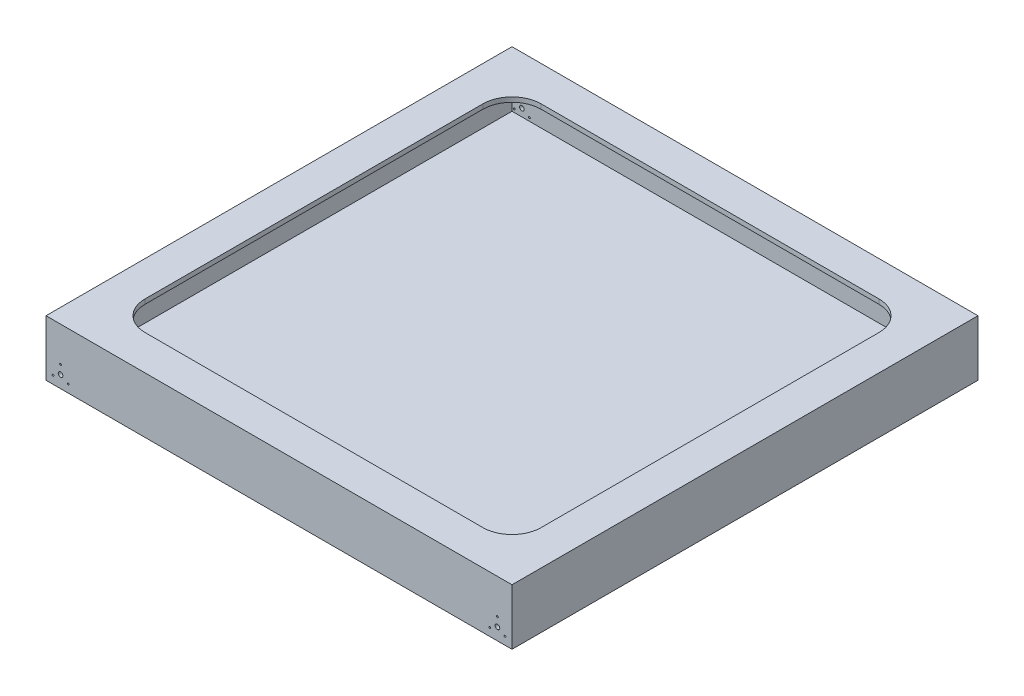
ISO-10303-21;
HEADER;
FILE_DESCRIPTION(('STEP AP214'),'2;1');
FILE_NAME('part.step','',(''),(''),'','','');
FILE_SCHEMA(('AUTOMOTIVE_DESIGN { 1 0 10303 214 1 1 1 1 }'));
ENDSEC;
DATA;
#1=APPLICATION_CONTEXT('core data for automotive mechanical design processes');
#2=APPLICATION_PROTOCOL_DEFINITION('international standard','automotive_design',2000,#1);
#3=PRODUCT_CONTEXT('',#1,'mechanical');
#4=PRODUCT('Part','Part','',(#3));
#5=PRODUCT_RELATED_PRODUCT_CATEGORY('part','',(#4));
#6=PRODUCT_DEFINITION_FORMATION('','',#4);
#7=PRODUCT_DEFINITION_CONTEXT('part definition',#1,'design');
#8=PRODUCT_DEFINITION('design','',#6,#7);
#9=PRODUCT_DEFINITION_SHAPE('','',#8);
#10=(LENGTH_UNIT() NAMED_UNIT(*) SI_UNIT(.MILLI.,.METRE.));
#11=(NAMED_UNIT(*) PLANE_ANGLE_UNIT() SI_UNIT($,.RADIAN.));
#12=(NAMED_UNIT(*) SI_UNIT($,.STERADIAN.) SOLID_ANGLE_UNIT());
#13=UNCERTAINTY_MEASURE_WITH_UNIT(LENGTH_MEASURE(1.E-05),#10,'distance_accuracy_value','');
#14=(GEOMETRIC_REPRESENTATION_CONTEXT(3) GLOBAL_UNCERTAINTY_ASSIGNED_CONTEXT((#13)) GLOBAL_UNIT_ASSIGNED_CONTEXT((#10,
#11,#12)) REPRESENTATION_CONTEXT('',''));
#15=CARTESIAN_POINT('',(0.,0.,0.));
#16=DIRECTION('',(0.,0.,1.));
#17=DIRECTION('',(1.,0.,0.));
#18=AXIS2_PLACEMENT_3D('',#15,#16,#17);
#19=CARTESIAN_POINT('',(-400.,8.,400.));
#20=DIRECTION('',(1.,0.,0.));
#21=DIRECTION('',(0.,0.,-1.));
#22=AXIS2_PLACEMENT_3D('',#19,#20,#21);
#23=PLANE('',#22);
#24=DIRECTION('',(0.,0.,1.));
#25=VECTOR('',#24,1.);
#26=CARTESIAN_POINT('',(-400.,0.,400.));
#27=LINE('',#26,#25);
#28=CARTESIAN_POINT('',(-400.,0.,-400.));
#29=VERTEX_POINT('',#28);
#30=CARTESIAN_POINT('',(-400.,0.,400.));
#31=VERTEX_POINT('',#30);
#32=EDGE_CURVE('E260',#29,#31,#27,.T.);
#33=ORIENTED_EDGE('',*,*,#32,.T.);
#34=DIRECTION('',(0.,-1.,0.));
#35=VECTOR('',#34,1.);
#36=CARTESIAN_POINT('',(-400.,8.,400.));
#37=LINE('',#36,#35);
#38=CARTESIAN_POINT('',(-400.,96.,400.));
#39=VERTEX_POINT('',#38);
#40=EDGE_CURVE('E11',#39,#31,#37,.T.);
#41=ORIENTED_EDGE('',*,*,#40,.F.);
#42=DIRECTION('',(0.,0.,1.));
#43=VECTOR('',#42,1.);
#44=CARTESIAN_POINT('',(-400.,96.,400.));
#45=LINE('',#44,#43);
#46=CARTESIAN_POINT('',(-400.,96.,-400.));
#47=VERTEX_POINT('',#46);
#48=EDGE_CURVE('E165',#47,#39,#45,.T.);
#49=ORIENTED_EDGE('',*,*,#48,.F.);
#50=DIRECTION('',(0.,-1.,0.));
#51=VECTOR('',#50,1.);
#52=CARTESIAN_POINT('',(-400.,8.,-400.));
#53=LINE('',#52,#51);
#54=EDGE_CURVE('E269',#47,#29,#53,.T.);
#55=ORIENTED_EDGE('',*,*,#54,.T.);
#56=EDGE_LOOP('',(#33,#41,#49,#55));
#57=FACE_BOUND('',#56,.T.);
#58=ADVANCED_FACE('F34',(#57),#23,.F.);
#59=CARTESIAN_POINT('',(400.,8.,400.));
#60=DIRECTION('',(0.,0.,-1.));
#61=DIRECTION('',(-1.,0.,0.));
#62=AXIS2_PLACEMENT_3D('',#59,#60,#61);
#63=PLANE('',#62);
#64=CARTESIAN_POINT('',(-387.990381056767,13.5000000000001,400.));
#65=DIRECTION('',(0.,0.,1.));
#66=DIRECTION('',(1.,0.,0.));
#67=AXIS2_PLACEMENT_3D('',#64,#65,#66);
#68=CIRCLE('',#67,1.49999999999997);
#69=CARTESIAN_POINT('',(-386.490381056767,13.5000000000001,400.));
#70=VERTEX_POINT('',#69);
#71=EDGE_CURVE('E330',#70,#70,#68,.T.);
#72=ORIENTED_EDGE('',*,*,#71,.F.);
#73=EDGE_LOOP('',(#72));
#74=FACE_BOUND('',#73,.T.);
#75=CARTESIAN_POINT('',(-362.009618943233,13.4999999999999,400.));
#76=DIRECTION('',(0.,0.,1.));
#77=DIRECTION('',(1.,0.,0.));
#78=AXIS2_PLACEMENT_3D('',#75,#76,#77);
#79=CIRCLE('',#78,1.50000000000009);
#80=CARTESIAN_POINT('',(-360.509618943233,13.4999999999999,400.));
#81=VERTEX_POINT('',#80);
#82=EDGE_CURVE('E336',#81,#81,#79,.T.);
#83=ORIENTED_EDGE('',*,*,#82,.F.);
#84=EDGE_LOOP('',(#83));
#85=FACE_BOUND('',#84,.T.);
#86=CARTESIAN_POINT('',(362.009618943234,13.4999999999999,400.));
#87=DIRECTION('',(0.,0.,1.));
#88=DIRECTION('',(-1.,0.,0.));
#89=AXIS2_PLACEMENT_3D('',#86,#87,#88);
#90=CIRCLE('',#89,1.49999999999997);
#91=CARTESIAN_POINT('',(360.509618943234,13.4999999999999,400.));
#92=VERTEX_POINT('',#91);
#93=EDGE_CURVE('E342',#92,#92,#90,.T.);
#94=ORIENTED_EDGE('',*,*,#93,.F.);
#95=EDGE_LOOP('',(#94));
#96=FACE_BOUND('',#95,.T.);
#97=CARTESIAN_POINT('',(387.990381056767,13.5000000000001,400.));
#98=DIRECTION('',(0.,0.,1.));
#99=DIRECTION('',(-1.,0.,0.));
#100=AXIS2_PLACEMENT_3D('',#97,#98,#99);
#101=CIRCLE('',#100,1.49999999999997);
#102=CARTESIAN_POINT('',(386.490381056767,13.5000000000001,400.));
#103=VERTEX_POINT('',#102);
#104=EDGE_CURVE('E348',#103,#103,#101,.T.);
#105=ORIENTED_EDGE('',*,*,#104,.F.);
#106=EDGE_LOOP('',(#105));
#107=FACE_BOUND('',#106,.T.);
#108=CARTESIAN_POINT('',(375.,36.,400.));
#109=DIRECTION('',(0.,0.,1.));
#110=DIRECTION('',(-1.,0.,0.));
#111=AXIS2_PLACEMENT_3D('',#108,#109,#110);
#112=CIRCLE('',#111,1.49999999999985);
#113=CARTESIAN_POINT('',(373.5,36.,400.));
#114=VERTEX_POINT('',#113);
#115=EDGE_CURVE('E313',#114,#114,#112,.T.);
#116=ORIENTED_EDGE('',*,*,#115,.F.);
#117=EDGE_LOOP('',(#116));
#118=FACE_BOUND('',#117,.T.);
#119=CARTESIAN_POINT('',(-375.,36.,400.));
#120=DIRECTION('',(0.,0.,1.));
#121=DIRECTION('',(1.,0.,0.));
#122=AXIS2_PLACEMENT_3D('',#119,#120,#121);
#123=CIRCLE('',#122,1.49999999999997);
#124=CARTESIAN_POINT('',(-373.5,36.,400.));
#125=VERTEX_POINT('',#124);
#126=EDGE_CURVE('E363',#125,#125,#123,.T.);
#127=ORIENTED_EDGE('',*,*,#126,.F.);
#128=EDGE_LOOP('',(#127));
#129=FACE_BOUND('',#128,.T.);
#130=CARTESIAN_POINT('',(375.,21.,400.));
#131=DIRECTION('',(0.,0.,1.));
#132=DIRECTION('',(-1.,0.,0.));
#133=AXIS2_PLACEMENT_3D('',#130,#131,#132);
#134=CIRCLE('',#133,3.99999999999999);
#135=CARTESIAN_POINT('',(371.,21.,400.));
#136=VERTEX_POINT('',#135);
#137=EDGE_CURVE('E370',#136,#136,#134,.T.);
#138=ORIENTED_EDGE('',*,*,#137,.F.);
#139=EDGE_LOOP('',(#138));
#140=FACE_BOUND('',#139,.T.);
#141=CARTESIAN_POINT('',(-375.,21.,400.));
#142=DIRECTION('',(0.,0.,1.));
#143=DIRECTION('',(1.,0.,0.));
#144=AXIS2_PLACEMENT_3D('',#141,#142,#143);
#145=CIRCLE('',#144,3.99999999999999);
#146=CARTESIAN_POINT('',(-371.,21.,400.));
#147=VERTEX_POINT('',#146);
#148=EDGE_CURVE('E377',#147,#147,#145,.T.);
#149=ORIENTED_EDGE('',*,*,#148,.F.);
#150=EDGE_LOOP('',(#149));
#151=FACE_BOUND('',#150,.T.);
#152=DIRECTION('',(1.,0.,0.));
#153=VECTOR('',#152,1.);
#154=CARTESIAN_POINT('',(400.,0.,400.));
#155=LINE('',#154,#153);
#156=CARTESIAN_POINT('',(400.,0.,400.));
#157=VERTEX_POINT('',#156);
#158=EDGE_CURVE('E263',#31,#157,#155,.T.);
#159=ORIENTED_EDGE('',*,*,#158,.T.);
#160=DIRECTION('',(0.,-1.,0.));
#161=VECTOR('',#160,1.);
#162=CARTESIAN_POINT('',(400.,8.,400.));
#163=LINE('',#162,#161);
#164=CARTESIAN_POINT('',(400.,96.,400.));
#165=VERTEX_POINT('',#164);
#166=EDGE_CURVE('E42',#165,#157,#163,.T.);
#167=ORIENTED_EDGE('',*,*,#166,.F.);
#168=DIRECTION('',(1.,0.,0.));
#169=VECTOR('',#168,1.);
#170=CARTESIAN_POINT('',(400.,96.,400.));
#171=LINE('',#170,#169);
#172=EDGE_CURVE('E222',#39,#165,#171,.T.);
#173=ORIENTED_EDGE('',*,*,#172,.F.);
#174=ORIENTED_EDGE('',*,*,#40,.T.);
#175=EDGE_LOOP('',(#159,#167,#173,#174));
#176=FACE_BOUND('',#175,.T.);
#177=ADVANCED_FACE('F444',(#74,#85,#96,#107,#118,#129,#140,#151,#176),#63,.F.);
#178=CARTESIAN_POINT('',(400.,8.,400.));
#179=DIRECTION('',(-1.,0.,0.));
#180=DIRECTION('',(0.,0.,1.));
#181=AXIS2_PLACEMENT_3D('',#178,#179,#180);
#182=PLANE('',#181);
#183=DIRECTION('',(0.,0.,-1.));
#184=VECTOR('',#183,1.);
#185=CARTESIAN_POINT('',(400.,0.,400.));
#186=LINE('',#185,#184);
#187=CARTESIAN_POINT('',(400.,0.,-400.));
#188=VERTEX_POINT('',#187);
#189=EDGE_CURVE('E265',#157,#188,#186,.T.);
#190=ORIENTED_EDGE('',*,*,#189,.T.);
#191=DIRECTION('',(0.,-1.,0.));
#192=VECTOR('',#191,1.);
#193=CARTESIAN_POINT('',(400.,8.,-400.));
#194=LINE('',#193,#192);
#195=CARTESIAN_POINT('',(400.,96.,-400.));
#196=VERTEX_POINT('',#195);
#197=EDGE_CURVE('E272',#196,#188,#194,.T.);
#198=ORIENTED_EDGE('',*,*,#197,.F.);
#199=DIRECTION('',(0.,0.,-1.));
#200=VECTOR('',#199,1.);
#201=CARTESIAN_POINT('',(400.,96.,400.));
#202=LINE('',#201,#200);
#203=EDGE_CURVE('E225',#165,#196,#202,.T.);
#204=ORIENTED_EDGE('',*,*,#203,.F.);
#205=ORIENTED_EDGE('',*,*,#166,.T.);
#206=EDGE_LOOP('',(#190,#198,#204,#205));
#207=FACE_BOUND('',#206,.T.);
#208=ADVANCED_FACE('F449',(#207),#182,.F.);
#209=CARTESIAN_POINT('',(400.,8.,-400.));
#210=DIRECTION('',(0.,0.,1.));
#211=DIRECTION('',(1.,0.,0.));
#212=AXIS2_PLACEMENT_3D('',#209,#210,#211);
#213=PLANE('',#212);
#214=CARTESIAN_POINT('',(-387.990381056767,13.5000000000001,-400.));
#215=DIRECTION('',(0.,0.,1.));
#216=DIRECTION('',(1.,0.,0.));
#217=AXIS2_PLACEMENT_3D('',#214,#215,#216);
#218=CIRCLE('',#217,1.49999999999997);
#219=CARTESIAN_POINT('',(-386.490381056767,13.5000000000001,-400.));
#220=VERTEX_POINT('',#219);
#221=EDGE_CURVE('E295',#220,#220,#218,.T.);
#222=ORIENTED_EDGE('',*,*,#221,.T.);
#223=EDGE_LOOP('',(#222));
#224=FACE_BOUND('',#223,.T.);
#225=CARTESIAN_POINT('',(-362.009618943233,13.4999999999999,-400.));
#226=DIRECTION('',(0.,0.,1.));
#227=DIRECTION('',(1.,0.,0.));
#228=AXIS2_PLACEMENT_3D('',#225,#226,#227);
#229=CIRCLE('',#228,1.50000000000009);
#230=CARTESIAN_POINT('',(-360.509618943233,13.4999999999999,-400.));
#231=VERTEX_POINT('',#230);
#232=EDGE_CURVE('E333',#231,#231,#229,.T.);
#233=ORIENTED_EDGE('',*,*,#232,.T.);
#234=EDGE_LOOP('',(#233));
#235=FACE_BOUND('',#234,.T.);
#236=CARTESIAN_POINT('',(362.009618943234,13.4999999999999,-400.));
#237=DIRECTION('',(0.,0.,1.));
#238=DIRECTION('',(-1.,0.,0.));
#239=AXIS2_PLACEMENT_3D('',#236,#237,#238);
#240=CIRCLE('',#239,1.49999999999997);
#241=CARTESIAN_POINT('',(360.509618943234,13.4999999999999,-400.));
#242=VERTEX_POINT('',#241);
#243=EDGE_CURVE('E339',#242,#242,#240,.T.);
#244=ORIENTED_EDGE('',*,*,#243,.T.);
#245=EDGE_LOOP('',(#244));
#246=FACE_BOUND('',#245,.T.);
#247=CARTESIAN_POINT('',(387.990381056767,13.5000000000001,-400.));
#248=DIRECTION('',(0.,0.,1.));
#249=DIRECTION('',(-1.,0.,0.));
#250=AXIS2_PLACEMENT_3D('',#247,#248,#249);
#251=CIRCLE('',#250,1.49999999999997);
#252=CARTESIAN_POINT('',(386.490381056767,13.5000000000001,-400.));
#253=VERTEX_POINT('',#252);
#254=EDGE_CURVE('E345',#253,#253,#251,.T.);
#255=ORIENTED_EDGE('',*,*,#254,.T.);
#256=EDGE_LOOP('',(#255));
#257=FACE_BOUND('',#256,.T.);
#258=CARTESIAN_POINT('',(375.,36.,-400.));
#259=DIRECTION('',(0.,0.,1.));
#260=DIRECTION('',(-1.,0.,0.));
#261=AXIS2_PLACEMENT_3D('',#258,#259,#260);
#262=CIRCLE('',#261,1.49999999999985);
#263=CARTESIAN_POINT('',(373.5,36.,-400.));
#264=VERTEX_POINT('',#263);
#265=EDGE_CURVE('E318',#264,#264,#262,.T.);
#266=ORIENTED_EDGE('',*,*,#265,.T.);
#267=EDGE_LOOP('',(#266));
#268=FACE_BOUND('',#267,.T.);
#269=CARTESIAN_POINT('',(-375.,36.,-400.));
#270=DIRECTION('',(0.,0.,1.));
#271=DIRECTION('',(1.,0.,0.));
#272=AXIS2_PLACEMENT_3D('',#269,#270,#271);
#273=CIRCLE('',#272,1.49999999999997);
#274=CARTESIAN_POINT('',(-373.5,36.,-400.));
#275=VERTEX_POINT('',#274);
#276=EDGE_CURVE('E290',#275,#275,#273,.T.);
#277=ORIENTED_EDGE('',*,*,#276,.T.);
#278=EDGE_LOOP('',(#277));
#279=FACE_BOUND('',#278,.T.);
#280=CARTESIAN_POINT('',(375.,21.,-400.));
#281=DIRECTION('',(0.,0.,1.));
#282=DIRECTION('',(-1.,0.,0.));
#283=AXIS2_PLACEMENT_3D('',#280,#281,#282);
#284=CIRCLE('',#283,3.99999999999999);
#285=CARTESIAN_POINT('',(371.,21.,-400.));
#286=VERTEX_POINT('',#285);
#287=EDGE_CURVE('E285',#286,#286,#284,.T.);
#288=ORIENTED_EDGE('',*,*,#287,.T.);
#289=EDGE_LOOP('',(#288));
#290=FACE_BOUND('',#289,.T.);
#291=CARTESIAN_POINT('',(-375.,21.,-400.));
#292=DIRECTION('',(0.,0.,1.));
#293=DIRECTION('',(1.,0.,0.));
#294=AXIS2_PLACEMENT_3D('',#291,#292,#293);
#295=CIRCLE('',#294,3.99999999999999);
#296=CARTESIAN_POINT('',(-371.,21.,-400.));
#297=VERTEX_POINT('',#296);
#298=EDGE_CURVE('E280',#297,#297,#295,.T.);
#299=ORIENTED_EDGE('',*,*,#298,.T.);
#300=EDGE_LOOP('',(#299));
#301=FACE_BOUND('',#300,.T.);
#302=DIRECTION('',(-1.,0.,0.));
#303=VECTOR('',#302,1.);
#304=CARTESIAN_POINT('',(400.,0.,-400.));
#305=LINE('',#304,#303);
#306=EDGE_CURVE('E267',#188,#29,#305,.T.);
#307=ORIENTED_EDGE('',*,*,#306,.T.);
#308=ORIENTED_EDGE('',*,*,#54,.F.);
#309=DIRECTION('',(-1.,0.,0.));
#310=VECTOR('',#309,1.);
#311=CARTESIAN_POINT('',(400.,96.,-400.));
#312=LINE('',#311,#310);
#313=EDGE_CURVE('E228',#196,#47,#312,.T.);
#314=ORIENTED_EDGE('',*,*,#313,.F.);
#315=ORIENTED_EDGE('',*,*,#197,.T.);
#316=EDGE_LOOP('',(#307,#308,#314,#315));
#317=FACE_BOUND('',#316,.T.);
#318=ADVANCED_FACE('F463',(#224,#235,#246,#257,#268,#279,#290,#301,#317),#213,.F.);
#319=CARTESIAN_POINT('',(0.,0.,0.));
#320=DIRECTION('',(0.,1.,0.));
#321=DIRECTION('',(0.,0.,1.));
#322=AXIS2_PLACEMENT_3D('',#319,#320,#321);
#323=PLANE('',#322);
#324=CARTESIAN_POINT('',(-346.85,0.,358.85));
#325=DIRECTION('',(0.,-1.,0.));
#326=DIRECTION('',(0.,0.,1.));
#327=AXIS2_PLACEMENT_3D('',#324,#325,#326);
#328=CIRCLE('',#327,3.99999999999999);
#329=CARTESIAN_POINT('',(-346.85,0.,362.85));
#330=VERTEX_POINT('',#329);
#331=EDGE_CURVE('E325',#330,#330,#328,.T.);
#332=ORIENTED_EDGE('',*,*,#331,.F.);
#333=EDGE_LOOP('',(#332));
#334=FACE_BOUND('',#333,.T.);
#335=CARTESIAN_POINT('',(346.85,0.,358.85));
#336=DIRECTION('',(0.,-1.,0.));
#337=DIRECTION('',(0.,0.,-1.));
#338=AXIS2_PLACEMENT_3D('',#335,#336,#337);
#339=CIRCLE('',#338,3.99999999999999);
#340=CARTESIAN_POINT('',(346.85,0.,354.85));
#341=VERTEX_POINT('',#340);
#342=EDGE_CURVE('E314',#341,#341,#339,.T.);
#343=ORIENTED_EDGE('',*,*,#342,.F.);
#344=EDGE_LOOP('',(#343));
#345=FACE_BOUND('',#344,.T.);
#346=ORIENTED_EDGE('',*,*,#32,.F.);
#347=ORIENTED_EDGE('',*,*,#306,.F.);
#348=ORIENTED_EDGE('',*,*,#189,.F.);
#349=ORIENTED_EDGE('',*,*,#158,.F.);
#350=EDGE_LOOP('',(#346,#347,#348,#349));
#351=FACE_BOUND('',#350,.T.);
#352=ADVANCED_FACE('F456',(#334,#345,#351),#323,.F.);
#353=CARTESIAN_POINT('',(0.,96.,0.));
#354=DIRECTION('',(0.,1.,0.));
#355=DIRECTION('',(0.,0.,1.));
#356=AXIS2_PLACEMENT_3D('',#353,#354,#355);
#357=PLANE('',#356);
#358=ORIENTED_EDGE('',*,*,#48,.T.);
#359=ORIENTED_EDGE('',*,*,#172,.T.);
#360=ORIENTED_EDGE('',*,*,#203,.T.);
#361=ORIENTED_EDGE('',*,*,#313,.T.);
#362=EDGE_LOOP('',(#358,#359,#360,#361));
#363=FACE_BOUND('',#362,.T.);
#364=DIRECTION('',(-1.,0.,0.));
#365=VECTOR('',#364,1.);
#366=CARTESIAN_POINT('',(290.,96.,-340.));
#367=LINE('',#366,#365);
#368=CARTESIAN_POINT('',(290.,96.,-340.));
#369=VERTEX_POINT('',#368);
#370=CARTESIAN_POINT('',(-290.,96.,-340.));
#371=VERTEX_POINT('',#370);
#372=EDGE_CURVE('E157',#369,#371,#367,.T.);
#373=ORIENTED_EDGE('',*,*,#372,.F.);
#374=CARTESIAN_POINT('',(290.,96.,-290.));
#375=DIRECTION('',(0.,1.,0.));
#376=DIRECTION('',(0.,0.,1.));
#377=AXIS2_PLACEMENT_3D('',#374,#375,#376);
#378=CIRCLE('',#377,50.);
#379=CARTESIAN_POINT('',(340.,96.,-290.));
#380=VERTEX_POINT('',#379);
#381=EDGE_CURVE('E147',#380,#369,#378,.T.);
#382=ORIENTED_EDGE('',*,*,#381,.F.);
#383=DIRECTION('',(0.,0.,-1.));
#384=VECTOR('',#383,1.);
#385=CARTESIAN_POINT('',(340.,96.,290.));
#386=LINE('',#385,#384);
#387=CARTESIAN_POINT('',(340.,96.,290.));
#388=VERTEX_POINT('',#387);
#389=EDGE_CURVE('E185',#388,#380,#386,.T.);
#390=ORIENTED_EDGE('',*,*,#389,.F.);
#391=CARTESIAN_POINT('',(290.,96.,290.));
#392=DIRECTION('',(0.,1.,0.));
#393=DIRECTION('',(0.,0.,1.));
#394=AXIS2_PLACEMENT_3D('',#391,#392,#393);
#395=CIRCLE('',#394,50.);
#396=CARTESIAN_POINT('',(290.,96.,340.));
#397=VERTEX_POINT('',#396);
#398=EDGE_CURVE('E182',#397,#388,#395,.T.);
#399=ORIENTED_EDGE('',*,*,#398,.F.);
#400=DIRECTION('',(1.,0.,0.));
#401=VECTOR('',#400,1.);
#402=CARTESIAN_POINT('',(290.,96.,340.));
#403=LINE('',#402,#401);
#404=CARTESIAN_POINT('',(-290.,96.,340.));
#405=VERTEX_POINT('',#404);
#406=EDGE_CURVE('E180',#405,#397,#403,.T.);
#407=ORIENTED_EDGE('',*,*,#406,.F.);
#408=CARTESIAN_POINT('',(-290.,96.,290.));
#409=DIRECTION('',(0.,1.,0.));
#410=DIRECTION('',(0.,0.,1.));
#411=AXIS2_PLACEMENT_3D('',#408,#409,#410);
#412=CIRCLE('',#411,50.);
#413=CARTESIAN_POINT('',(-340.,96.,290.));
#414=VERTEX_POINT('',#413);
#415=EDGE_CURVE('E178',#414,#405,#412,.T.);
#416=ORIENTED_EDGE('',*,*,#415,.F.);
#417=DIRECTION('',(0.,0.,1.));
#418=VECTOR('',#417,1.);
#419=CARTESIAN_POINT('',(-340.,96.,290.));
#420=LINE('',#419,#418);
#421=CARTESIAN_POINT('',(-340.,96.,-290.));
#422=VERTEX_POINT('',#421);
#423=EDGE_CURVE('E173',#422,#414,#420,.T.);
#424=ORIENTED_EDGE('',*,*,#423,.F.);
#425=CARTESIAN_POINT('',(-290.,96.,-290.));
#426=DIRECTION('',(0.,1.,0.));
#427=DIRECTION('',(0.,0.,1.));
#428=AXIS2_PLACEMENT_3D('',#425,#426,#427);
#429=CIRCLE('',#428,50.);
#430=EDGE_CURVE('E171',#371,#422,#429,.T.);
#431=ORIENTED_EDGE('',*,*,#430,.F.);
#432=EDGE_LOOP('',(#373,#382,#390,#399,#407,#416,#424,#431));
#433=FACE_BOUND('',#432,.T.);
#434=ADVANCED_FACE('F169',(#363,#433),#357,.T.);
#435=CARTESIAN_POINT('',(0.,88.,0.));
#436=DIRECTION('',(0.,1.,0.));
#437=DIRECTION('',(0.,0.,1.));
#438=AXIS2_PLACEMENT_3D('',#435,#436,#437);
#439=PLANE('',#438);
#440=DIRECTION('',(0.,0.,1.));
#441=VECTOR('',#440,1.);
#442=CARTESIAN_POINT('',(-392.,88.,392.));
#443=LINE('',#442,#441);
#444=CARTESIAN_POINT('',(-392.,88.,-392.));
#445=VERTEX_POINT('',#444);
#446=CARTESIAN_POINT('',(-392.,88.,392.));
#447=VERTEX_POINT('',#446);
#448=EDGE_CURVE('E231',#445,#447,#443,.T.);
#449=ORIENTED_EDGE('',*,*,#448,.F.);
#450=DIRECTION('',(-1.,0.,0.));
#451=VECTOR('',#450,1.);
#452=CARTESIAN_POINT('',(392.,88.,-392.));
#453=LINE('',#452,#451);
#454=CARTESIAN_POINT('',(392.,88.,-392.));
#455=VERTEX_POINT('',#454);
#456=EDGE_CURVE('E241',#455,#445,#453,.T.);
#457=ORIENTED_EDGE('',*,*,#456,.F.);
#458=DIRECTION('',(0.,0.,-1.));
#459=VECTOR('',#458,1.);
#460=CARTESIAN_POINT('',(392.,88.,392.));
#461=LINE('',#460,#459);
#462=CARTESIAN_POINT('',(392.,88.,392.));
#463=VERTEX_POINT('',#462);
#464=EDGE_CURVE('E238',#463,#455,#461,.T.);
#465=ORIENTED_EDGE('',*,*,#464,.F.);
#466=DIRECTION('',(1.,0.,0.));
#467=VECTOR('',#466,1.);
#468=CARTESIAN_POINT('',(392.,88.,392.));
#469=LINE('',#468,#467);
#470=EDGE_CURVE('E234',#447,#463,#469,.T.);
#471=ORIENTED_EDGE('',*,*,#470,.F.);
#472=EDGE_LOOP('',(#449,#457,#465,#471));
#473=FACE_BOUND('',#472,.T.);
#474=CARTESIAN_POINT('',(290.,88.,-290.));
#475=DIRECTION('',(0.,1.,0.));
#476=DIRECTION('',(0.,0.,1.));
#477=AXIS2_PLACEMENT_3D('',#474,#475,#476);
#478=CIRCLE('',#477,50.);
#479=CARTESIAN_POINT('',(340.,88.,-290.));
#480=VERTEX_POINT('',#479);
#481=CARTESIAN_POINT('',(290.,88.,-340.));
#482=VERTEX_POINT('',#481);
#483=EDGE_CURVE('E187',#480,#482,#478,.T.);
#484=ORIENTED_EDGE('',*,*,#483,.T.);
#485=DIRECTION('',(-1.,0.,0.));
#486=VECTOR('',#485,1.);
#487=CARTESIAN_POINT('',(290.,88.,-340.));
#488=LINE('',#487,#486);
#489=CARTESIAN_POINT('',(-290.,88.,-340.));
#490=VERTEX_POINT('',#489);
#491=EDGE_CURVE('E164',#482,#490,#488,.T.);
#492=ORIENTED_EDGE('',*,*,#491,.T.);
#493=CARTESIAN_POINT('',(-290.,88.,-290.));
#494=DIRECTION('',(0.,1.,0.));
#495=DIRECTION('',(0.,0.,1.));
#496=AXIS2_PLACEMENT_3D('',#493,#494,#495);
#497=CIRCLE('',#496,50.);
#498=CARTESIAN_POINT('',(-340.,88.,-290.));
#499=VERTEX_POINT('',#498);
#500=EDGE_CURVE('E191',#490,#499,#497,.T.);
#501=ORIENTED_EDGE('',*,*,#500,.T.);
#502=DIRECTION('',(0.,0.,1.));
#503=VECTOR('',#502,1.);
#504=CARTESIAN_POINT('',(-340.,88.,290.));
#505=LINE('',#504,#503);
#506=CARTESIAN_POINT('',(-340.,88.,290.));
#507=VERTEX_POINT('',#506);
#508=EDGE_CURVE('E194',#499,#507,#505,.T.);
#509=ORIENTED_EDGE('',*,*,#508,.T.);
#510=CARTESIAN_POINT('',(-290.,88.,290.));
#511=DIRECTION('',(0.,1.,0.));
#512=DIRECTION('',(0.,0.,1.));
#513=AXIS2_PLACEMENT_3D('',#510,#511,#512);
#514=CIRCLE('',#513,50.);
#515=CARTESIAN_POINT('',(-290.,88.,340.));
#516=VERTEX_POINT('',#515);
#517=EDGE_CURVE('E197',#507,#516,#514,.T.);
#518=ORIENTED_EDGE('',*,*,#517,.T.);
#519=DIRECTION('',(1.,0.,0.));
#520=VECTOR('',#519,1.);
#521=CARTESIAN_POINT('',(290.,88.,340.));
#522=LINE('',#521,#520);
#523=CARTESIAN_POINT('',(290.,88.,340.));
#524=VERTEX_POINT('',#523);
#525=EDGE_CURVE('E200',#516,#524,#522,.T.);
#526=ORIENTED_EDGE('',*,*,#525,.T.);
#527=CARTESIAN_POINT('',(290.,88.,290.));
#528=DIRECTION('',(0.,1.,0.));
#529=DIRECTION('',(0.,0.,1.));
#530=AXIS2_PLACEMENT_3D('',#527,#528,#529);
#531=CIRCLE('',#530,50.);
#532=CARTESIAN_POINT('',(340.,88.,290.));
#533=VERTEX_POINT('',#532);
#534=EDGE_CURVE('E203',#524,#533,#531,.T.);
#535=ORIENTED_EDGE('',*,*,#534,.T.);
#536=DIRECTION('',(0.,0.,-1.));
#537=VECTOR('',#536,1.);
#538=CARTESIAN_POINT('',(340.,88.,290.));
#539=LINE('',#538,#537);
#540=EDGE_CURVE('E158',#533,#480,#539,.T.);
#541=ORIENTED_EDGE('',*,*,#540,.T.);
#542=EDGE_LOOP('',(#484,#492,#501,#509,#518,#526,#535,#541));
#543=FACE_BOUND('',#542,.T.);
#544=ADVANCED_FACE('F406',(#473,#543),#439,.F.);
#545=CARTESIAN_POINT('',(290.,96.,-290.));
#546=DIRECTION('',(0.,-1.,0.));
#547=DIRECTION('',(0.,0.,-1.));
#548=AXIS2_PLACEMENT_3D('',#545,#546,#547);
#549=CYLINDRICAL_SURFACE('',#548,50.);
#550=ORIENTED_EDGE('',*,*,#483,.F.);
#551=DIRECTION('',(0.,-1.,0.));
#552=VECTOR('',#551,1.);
#553=CARTESIAN_POINT('',(340.,96.,-290.));
#554=LINE('',#553,#552);
#555=EDGE_CURVE('E153',#380,#480,#554,.T.);
#556=ORIENTED_EDGE('',*,*,#555,.F.);
#557=ORIENTED_EDGE('',*,*,#381,.T.);
#558=DIRECTION('',(0.,-1.,0.));
#559=VECTOR('',#558,1.);
#560=CARTESIAN_POINT('',(290.,96.,-340.));
#561=LINE('',#560,#559);
#562=EDGE_CURVE('E150',#369,#482,#561,.T.);
#563=ORIENTED_EDGE('',*,*,#562,.T.);
#564=EDGE_LOOP('',(#550,#556,#557,#563));
#565=FACE_BOUND('',#564,.T.);
#566=ADVANCED_FACE('F149',(#565),#549,.F.);
#567=CARTESIAN_POINT('',(290.,96.,-340.));
#568=DIRECTION('',(0.,0.,1.));
#569=DIRECTION('',(1.,0.,0.));
#570=AXIS2_PLACEMENT_3D('',#567,#568,#569);
#571=PLANE('',#570);
#572=ORIENTED_EDGE('',*,*,#491,.F.);
#573=ORIENTED_EDGE('',*,*,#562,.F.);
#574=ORIENTED_EDGE('',*,*,#372,.T.);
#575=DIRECTION('',(0.,-1.,0.));
#576=VECTOR('',#575,1.);
#577=CARTESIAN_POINT('',(-290.,96.,-340.));
#578=LINE('',#577,#576);
#579=EDGE_CURVE('E166',#371,#490,#578,.T.);
#580=ORIENTED_EDGE('',*,*,#579,.T.);
#581=EDGE_LOOP('',(#572,#573,#574,#580));
#582=FACE_BOUND('',#581,.T.);
#583=ADVANCED_FACE('F161',(#582),#571,.T.);
#584=CARTESIAN_POINT('',(-290.,96.,-290.));
#585=DIRECTION('',(0.,-1.,0.));
#586=DIRECTION('',(0.,0.,-1.));
#587=AXIS2_PLACEMENT_3D('',#584,#585,#586);
#588=CYLINDRICAL_SURFACE('',#587,50.);
#589=ORIENTED_EDGE('',*,*,#500,.F.);
#590=ORIENTED_EDGE('',*,*,#579,.F.);
#591=ORIENTED_EDGE('',*,*,#430,.T.);
#592=DIRECTION('',(0.,-1.,0.));
#593=VECTOR('',#592,1.);
#594=CARTESIAN_POINT('',(-340.,96.,-290.));
#595=LINE('',#594,#593);
#596=EDGE_CURVE('E217',#422,#499,#595,.T.);
#597=ORIENTED_EDGE('',*,*,#596,.T.);
#598=EDGE_LOOP('',(#589,#590,#591,#597));
#599=FACE_BOUND('',#598,.T.);
#600=ADVANCED_FACE('F434',(#599),#588,.F.);
#601=CARTESIAN_POINT('',(-340.,96.,290.));
#602=DIRECTION('',(1.,0.,0.));
#603=DIRECTION('',(0.,0.,-1.));
#604=AXIS2_PLACEMENT_3D('',#601,#602,#603);
#605=PLANE('',#604);
#606=ORIENTED_EDGE('',*,*,#508,.F.);
#607=ORIENTED_EDGE('',*,*,#596,.F.);
#608=ORIENTED_EDGE('',*,*,#423,.T.);
#609=DIRECTION('',(0.,-1.,0.));
#610=VECTOR('',#609,1.);
#611=CARTESIAN_POINT('',(-340.,96.,290.));
#612=LINE('',#611,#610);
#613=EDGE_CURVE('E215',#414,#507,#612,.T.);
#614=ORIENTED_EDGE('',*,*,#613,.T.);
#615=EDGE_LOOP('',(#606,#607,#608,#614));
#616=FACE_BOUND('',#615,.T.);
#617=ADVANCED_FACE('F431',(#616),#605,.T.);
#618=CARTESIAN_POINT('',(-290.,96.,290.));
#619=DIRECTION('',(0.,-1.,0.));
#620=DIRECTION('',(0.,0.,-1.));
#621=AXIS2_PLACEMENT_3D('',#618,#619,#620);
#622=CYLINDRICAL_SURFACE('',#621,50.);
#623=ORIENTED_EDGE('',*,*,#517,.F.);
#624=ORIENTED_EDGE('',*,*,#613,.F.);
#625=ORIENTED_EDGE('',*,*,#415,.T.);
#626=DIRECTION('',(0.,-1.,0.));
#627=VECTOR('',#626,1.);
#628=CARTESIAN_POINT('',(-290.,96.,340.));
#629=LINE('',#628,#627);
#630=EDGE_CURVE('E213',#405,#516,#629,.T.);
#631=ORIENTED_EDGE('',*,*,#630,.T.);
#632=EDGE_LOOP('',(#623,#624,#625,#631));
#633=FACE_BOUND('',#632,.T.);
#634=ADVANCED_FACE('F426',(#633),#622,.F.);
#635=CARTESIAN_POINT('',(290.,96.,340.));
#636=DIRECTION('',(0.,0.,-1.));
#637=DIRECTION('',(-1.,0.,0.));
#638=AXIS2_PLACEMENT_3D('',#635,#636,#637);
#639=PLANE('',#638);
#640=ORIENTED_EDGE('',*,*,#525,.F.);
#641=ORIENTED_EDGE('',*,*,#630,.F.);
#642=ORIENTED_EDGE('',*,*,#406,.T.);
#643=DIRECTION('',(0.,-1.,0.));
#644=VECTOR('',#643,1.);
#645=CARTESIAN_POINT('',(290.,96.,340.));
#646=LINE('',#645,#644);
#647=EDGE_CURVE('E211',#397,#524,#646,.T.);
#648=ORIENTED_EDGE('',*,*,#647,.T.);
#649=EDGE_LOOP('',(#640,#641,#642,#648));
#650=FACE_BOUND('',#649,.T.);
#651=ADVANCED_FACE('F422',(#650),#639,.T.);
#652=CARTESIAN_POINT('',(290.,96.,290.));
#653=DIRECTION('',(0.,-1.,0.));
#654=DIRECTION('',(0.,0.,-1.));
#655=AXIS2_PLACEMENT_3D('',#652,#653,#654);
#656=CYLINDRICAL_SURFACE('',#655,50.);
#657=ORIENTED_EDGE('',*,*,#534,.F.);
#658=ORIENTED_EDGE('',*,*,#647,.F.);
#659=ORIENTED_EDGE('',*,*,#398,.T.);
#660=DIRECTION('',(0.,-1.,0.));
#661=VECTOR('',#660,1.);
#662=CARTESIAN_POINT('',(340.,96.,290.));
#663=LINE('',#662,#661);
#664=EDGE_CURVE('E209',#388,#533,#663,.T.);
#665=ORIENTED_EDGE('',*,*,#664,.T.);
#666=EDGE_LOOP('',(#657,#658,#659,#665));
#667=FACE_BOUND('',#666,.T.);
#668=ADVANCED_FACE('F419',(#667),#656,.F.);
#669=CARTESIAN_POINT('',(340.,96.,290.));
#670=DIRECTION('',(-1.,0.,0.));
#671=DIRECTION('',(0.,0.,1.));
#672=AXIS2_PLACEMENT_3D('',#669,#670,#671);
#673=PLANE('',#672);
#674=ORIENTED_EDGE('',*,*,#540,.F.);
#675=ORIENTED_EDGE('',*,*,#664,.F.);
#676=ORIENTED_EDGE('',*,*,#389,.T.);
#677=ORIENTED_EDGE('',*,*,#555,.T.);
#678=EDGE_LOOP('',(#674,#675,#676,#677));
#679=FACE_BOUND('',#678,.T.);
#680=ADVANCED_FACE('F412',(#679),#673,.T.);
#681=CARTESIAN_POINT('',(0.,8.,0.));
#682=DIRECTION('',(0.,1.,0.));
#683=DIRECTION('',(0.,0.,1.));
#684=AXIS2_PLACEMENT_3D('',#681,#682,#683);
#685=PLANE('',#684);
#686=CARTESIAN_POINT('',(-346.85,8.,358.85));
#687=DIRECTION('',(0.,1.,0.));
#688=DIRECTION('',(0.,0.,1.));
#689=AXIS2_PLACEMENT_3D('',#686,#687,#688);
#690=CIRCLE('',#689,3.99999999999999);
#691=CARTESIAN_POINT('',(-346.85,8.,362.85));
#692=VERTEX_POINT('',#691);
#693=EDGE_CURVE('E37',#692,#692,#690,.T.);
#694=ORIENTED_EDGE('',*,*,#693,.F.);
#695=EDGE_LOOP('',(#694));
#696=FACE_BOUND('',#695,.T.);
#697=CARTESIAN_POINT('',(346.85,8.,358.85));
#698=DIRECTION('',(0.,1.,0.));
#699=DIRECTION('',(0.,0.,1.));
#700=AXIS2_PLACEMENT_3D('',#697,#698,#699);
#701=CIRCLE('',#700,3.99999999999999);
#702=CARTESIAN_POINT('',(346.85,8.,362.85));
#703=VERTEX_POINT('',#702);
#704=EDGE_CURVE('E311',#703,#703,#701,.T.);
#705=ORIENTED_EDGE('',*,*,#704,.F.);
#706=EDGE_LOOP('',(#705));
#707=FACE_BOUND('',#706,.T.);
#708=DIRECTION('',(0.,0.,1.));
#709=VECTOR('',#708,1.);
#710=CARTESIAN_POINT('',(-392.,8.,392.));
#711=LINE('',#710,#709);
#712=CARTESIAN_POINT('',(-392.,8.,-392.));
#713=VERTEX_POINT('',#712);
#714=CARTESIAN_POINT('',(-392.,8.,392.));
#715=VERTEX_POINT('',#714);
#716=EDGE_CURVE('E50',#713,#715,#711,.T.);
#717=ORIENTED_EDGE('',*,*,#716,.T.);
#718=DIRECTION('',(1.,0.,0.));
#719=VECTOR('',#718,1.);
#720=CARTESIAN_POINT('',(392.,8.,392.));
#721=LINE('',#720,#719);
#722=CARTESIAN_POINT('',(392.,8.,392.));
#723=VERTEX_POINT('',#722);
#724=EDGE_CURVE('E54',#715,#723,#721,.T.);
#725=ORIENTED_EDGE('',*,*,#724,.T.);
#726=DIRECTION('',(0.,0.,-1.));
#727=VECTOR('',#726,1.);
#728=CARTESIAN_POINT('',(392.,8.,392.));
#729=LINE('',#728,#727);
#730=CARTESIAN_POINT('',(392.,8.,-392.));
#731=VERTEX_POINT('',#730);
#732=EDGE_CURVE('E247',#723,#731,#729,.T.);
#733=ORIENTED_EDGE('',*,*,#732,.T.);
#734=DIRECTION('',(-1.,0.,0.));
#735=VECTOR('',#734,1.);
#736=CARTESIAN_POINT('',(392.,8.,-392.));
#737=LINE('',#736,#735);
#738=EDGE_CURVE('E235',#731,#713,#737,.T.);
#739=ORIENTED_EDGE('',*,*,#738,.T.);
#740=EDGE_LOOP('',(#717,#725,#733,#739));
#741=FACE_BOUND('',#740,.T.);
#742=ADVANCED_FACE('F391',(#696,#707,#741),#685,.T.);
#743=CARTESIAN_POINT('',(392.,88.,-392.));
#744=DIRECTION('',(0.,0.,1.));
#745=DIRECTION('',(1.,0.,0.));
#746=AXIS2_PLACEMENT_3D('',#743,#744,#745);
#747=PLANE('',#746);
#748=CARTESIAN_POINT('',(-387.990381056767,13.5000000000001,-392.));
#749=DIRECTION('',(0.,0.,1.));
#750=DIRECTION('',(1.,0.,0.));
#751=AXIS2_PLACEMENT_3D('',#748,#749,#750);
#752=CIRCLE('',#751,1.49999999999997);
#753=CARTESIAN_POINT('',(-386.490381056767,13.5000000000001,-392.));
#754=VERTEX_POINT('',#753);
#755=EDGE_CURVE('E310',#754,#754,#752,.T.);
#756=ORIENTED_EDGE('',*,*,#755,.F.);
#757=EDGE_LOOP('',(#756));
#758=FACE_BOUND('',#757,.T.);
#759=CARTESIAN_POINT('',(-362.009618943233,13.4999999999999,-392.));
#760=DIRECTION('',(0.,0.,1.));
#761=DIRECTION('',(1.,0.,0.));
#762=AXIS2_PLACEMENT_3D('',#759,#760,#761);
#763=CIRCLE('',#762,1.50000000000009);
#764=CARTESIAN_POINT('',(-360.509618943233,13.4999999999999,-392.));
#765=VERTEX_POINT('',#764);
#766=EDGE_CURVE('E307',#765,#765,#763,.T.);
#767=ORIENTED_EDGE('',*,*,#766,.F.);
#768=EDGE_LOOP('',(#767));
#769=FACE_BOUND('',#768,.T.);
#770=CARTESIAN_POINT('',(362.009618943234,13.4999999999999,-392.));
#771=DIRECTION('',(0.,0.,1.));
#772=DIRECTION('',(1.,0.,0.));
#773=AXIS2_PLACEMENT_3D('',#770,#771,#772);
#774=CIRCLE('',#773,1.49999999999997);
#775=CARTESIAN_POINT('',(363.509618943234,13.4999999999999,-392.));
#776=VERTEX_POINT('',#775);
#777=EDGE_CURVE('E303',#776,#776,#774,.T.);
#778=ORIENTED_EDGE('',*,*,#777,.F.);
#779=EDGE_LOOP('',(#778));
#780=FACE_BOUND('',#779,.T.);
#781=CARTESIAN_POINT('',(387.990381056767,13.5000000000001,-392.));
#782=DIRECTION('',(0.,0.,1.));
#783=DIRECTION('',(1.,0.,0.));
#784=AXIS2_PLACEMENT_3D('',#781,#782,#783);
#785=CIRCLE('',#784,1.49999999999997);
#786=CARTESIAN_POINT('',(389.490381056767,13.5000000000001,-392.));
#787=VERTEX_POINT('',#786);
#788=EDGE_CURVE('E299',#787,#787,#785,.T.);
#789=ORIENTED_EDGE('',*,*,#788,.F.);
#790=EDGE_LOOP('',(#789));
#791=FACE_BOUND('',#790,.T.);
#792=CARTESIAN_POINT('',(375.,36.,-392.));
#793=DIRECTION('',(0.,0.,1.));
#794=DIRECTION('',(1.,0.,0.));
#795=AXIS2_PLACEMENT_3D('',#792,#793,#794);
#796=CIRCLE('',#795,1.49999999999985);
#797=CARTESIAN_POINT('',(376.5,36.,-392.));
#798=VERTEX_POINT('',#797);
#799=EDGE_CURVE('E294',#798,#798,#796,.T.);
#800=ORIENTED_EDGE('',*,*,#799,.F.);
#801=EDGE_LOOP('',(#800));
#802=FACE_BOUND('',#801,.T.);
#803=CARTESIAN_POINT('',(-375.,36.,-392.));
#804=DIRECTION('',(0.,0.,1.));
#805=DIRECTION('',(1.,0.,0.));
#806=AXIS2_PLACEMENT_3D('',#803,#804,#805);
#807=CIRCLE('',#806,1.49999999999997);
#808=CARTESIAN_POINT('',(-373.5,36.,-392.));
#809=VERTEX_POINT('',#808);
#810=EDGE_CURVE('E289',#809,#809,#807,.T.);
#811=ORIENTED_EDGE('',*,*,#810,.F.);
#812=EDGE_LOOP('',(#811));
#813=FACE_BOUND('',#812,.T.);
#814=CARTESIAN_POINT('',(375.,21.,-392.));
#815=DIRECTION('',(0.,0.,1.));
#816=DIRECTION('',(1.,0.,0.));
#817=AXIS2_PLACEMENT_3D('',#814,#815,#816);
#818=CIRCLE('',#817,3.99999999999999);
#819=CARTESIAN_POINT('',(379.,21.,-392.));
#820=VERTEX_POINT('',#819);
#821=EDGE_CURVE('E284',#820,#820,#818,.T.);
#822=ORIENTED_EDGE('',*,*,#821,.F.);
#823=EDGE_LOOP('',(#822));
#824=FACE_BOUND('',#823,.T.);
#825=CARTESIAN_POINT('',(-375.,21.,-392.));
#826=DIRECTION('',(0.,0.,1.));
#827=DIRECTION('',(1.,0.,0.));
#828=AXIS2_PLACEMENT_3D('',#825,#826,#827);
#829=CIRCLE('',#828,3.99999999999999);
#830=CARTESIAN_POINT('',(-371.,21.,-392.));
#831=VERTEX_POINT('',#830);
#832=EDGE_CURVE('E189',#831,#831,#829,.T.);
#833=ORIENTED_EDGE('',*,*,#832,.F.);
#834=EDGE_LOOP('',(#833));
#835=FACE_BOUND('',#834,.T.);
#836=ORIENTED_EDGE('',*,*,#738,.F.);
#837=DIRECTION('',(0.,-1.,0.));
#838=VECTOR('',#837,1.);
#839=CARTESIAN_POINT('',(392.,88.,-392.));
#840=LINE('',#839,#838);
#841=EDGE_CURVE('E252',#455,#731,#840,.T.);
#842=ORIENTED_EDGE('',*,*,#841,.F.);
#843=ORIENTED_EDGE('',*,*,#456,.T.);
#844=DIRECTION('',(0.,-1.,0.));
#845=VECTOR('',#844,1.);
#846=CARTESIAN_POINT('',(-392.,88.,-392.));
#847=LINE('',#846,#845);
#848=EDGE_CURVE('E244',#445,#713,#847,.T.);
#849=ORIENTED_EDGE('',*,*,#848,.T.);
#850=EDGE_LOOP('',(#836,#842,#843,#849));
#851=FACE_BOUND('',#850,.T.);
#852=ADVANCED_FACE('F387',(#758,#769,#780,#791,#802,#813,#824,#835,#851),#747,.T.);
#853=CARTESIAN_POINT('',(392.,88.,392.));
#854=DIRECTION('',(-1.,0.,0.));
#855=DIRECTION('',(0.,0.,1.));
#856=AXIS2_PLACEMENT_3D('',#853,#854,#855);
#857=PLANE('',#856);
#858=ORIENTED_EDGE('',*,*,#732,.F.);
#859=DIRECTION('',(0.,-1.,0.));
#860=VECTOR('',#859,1.);
#861=CARTESIAN_POINT('',(392.,88.,392.));
#862=LINE('',#861,#860);
#863=EDGE_CURVE('E255',#463,#723,#862,.T.);
#864=ORIENTED_EDGE('',*,*,#863,.F.);
#865=ORIENTED_EDGE('',*,*,#464,.T.);
#866=ORIENTED_EDGE('',*,*,#841,.T.);
#867=EDGE_LOOP('',(#858,#864,#865,#866));
#868=FACE_BOUND('',#867,.T.);
#869=ADVANCED_FACE('F390',(#868),#857,.T.);
#870=CARTESIAN_POINT('',(392.,88.,392.));
#871=DIRECTION('',(0.,0.,-1.));
#872=DIRECTION('',(-1.,0.,0.));
#873=AXIS2_PLACEMENT_3D('',#870,#871,#872);
#874=PLANE('',#873);
#875=CARTESIAN_POINT('',(-387.990381056767,13.5000000000001,392.));
#876=DIRECTION('',(0.,0.,-1.));
#877=DIRECTION('',(-1.,0.,0.));
#878=AXIS2_PLACEMENT_3D('',#875,#876,#877);
#879=CIRCLE('',#878,1.49999999999997);
#880=CARTESIAN_POINT('',(-389.490381056767,13.5000000000001,392.));
#881=VERTEX_POINT('',#880);
#882=EDGE_CURVE('E308',#881,#881,#879,.T.);
#883=ORIENTED_EDGE('',*,*,#882,.F.);
#884=EDGE_LOOP('',(#883));
#885=FACE_BOUND('',#884,.T.);
#886=CARTESIAN_POINT('',(-362.009618943233,13.4999999999999,392.));
#887=DIRECTION('',(0.,0.,-1.));
#888=DIRECTION('',(-1.,0.,0.));
#889=AXIS2_PLACEMENT_3D('',#886,#887,#888);
#890=CIRCLE('',#889,1.50000000000009);
#891=CARTESIAN_POINT('',(-363.509618943234,13.4999999999999,392.));
#892=VERTEX_POINT('',#891);
#893=EDGE_CURVE('E304',#892,#892,#890,.T.);
#894=ORIENTED_EDGE('',*,*,#893,.F.);
#895=EDGE_LOOP('',(#894));
#896=FACE_BOUND('',#895,.T.);
#897=CARTESIAN_POINT('',(362.009618943234,13.4999999999999,392.));
#898=DIRECTION('',(0.,0.,-1.));
#899=DIRECTION('',(-1.,0.,0.));
#900=AXIS2_PLACEMENT_3D('',#897,#898,#899);
#901=CIRCLE('',#900,1.49999999999997);
#902=CARTESIAN_POINT('',(360.509618943234,13.4999999999999,392.));
#903=VERTEX_POINT('',#902);
#904=EDGE_CURVE('E300',#903,#903,#901,.T.);
#905=ORIENTED_EDGE('',*,*,#904,.F.);
#906=EDGE_LOOP('',(#905));
#907=FACE_BOUND('',#906,.T.);
#908=CARTESIAN_POINT('',(387.990381056767,13.5000000000001,392.));
#909=DIRECTION('',(0.,0.,-1.));
#910=DIRECTION('',(-1.,0.,0.));
#911=AXIS2_PLACEMENT_3D('',#908,#909,#910);
#912=CIRCLE('',#911,1.49999999999997);
#913=CARTESIAN_POINT('',(386.490381056767,13.5000000000001,392.));
#914=VERTEX_POINT('',#913);
#915=EDGE_CURVE('E296',#914,#914,#912,.T.);
#916=ORIENTED_EDGE('',*,*,#915,.F.);
#917=EDGE_LOOP('',(#916));
#918=FACE_BOUND('',#917,.T.);
#919=CARTESIAN_POINT('',(375.,36.,392.));
#920=DIRECTION('',(0.,0.,-1.));
#921=DIRECTION('',(-1.,0.,0.));
#922=AXIS2_PLACEMENT_3D('',#919,#920,#921);
#923=CIRCLE('',#922,1.49999999999985);
#924=CARTESIAN_POINT('',(373.5,36.,392.));
#925=VERTEX_POINT('',#924);
#926=EDGE_CURVE('E291',#925,#925,#923,.T.);
#927=ORIENTED_EDGE('',*,*,#926,.F.);
#928=EDGE_LOOP('',(#927));
#929=FACE_BOUND('',#928,.T.);
#930=CARTESIAN_POINT('',(-375.,36.,392.));
#931=DIRECTION('',(0.,0.,-1.));
#932=DIRECTION('',(-1.,0.,0.));
#933=AXIS2_PLACEMENT_3D('',#930,#931,#932);
#934=CIRCLE('',#933,1.49999999999997);
#935=CARTESIAN_POINT('',(-376.5,36.,392.));
#936=VERTEX_POINT('',#935);
#937=EDGE_CURVE('E286',#936,#936,#934,.T.);
#938=ORIENTED_EDGE('',*,*,#937,.F.);
#939=EDGE_LOOP('',(#938));
#940=FACE_BOUND('',#939,.T.);
#941=CARTESIAN_POINT('',(375.,21.,392.));
#942=DIRECTION('',(0.,0.,-1.));
#943=DIRECTION('',(-1.,0.,0.));
#944=AXIS2_PLACEMENT_3D('',#941,#942,#943);
#945=CIRCLE('',#944,3.99999999999999);
#946=CARTESIAN_POINT('',(371.,21.,392.));
#947=VERTEX_POINT('',#946);
#948=EDGE_CURVE('E281',#947,#947,#945,.T.);
#949=ORIENTED_EDGE('',*,*,#948,.F.);
#950=EDGE_LOOP('',(#949));
#951=FACE_BOUND('',#950,.T.);
#952=CARTESIAN_POINT('',(-375.,21.,392.));
#953=DIRECTION('',(0.,0.,-1.));
#954=DIRECTION('',(-1.,0.,0.));
#955=AXIS2_PLACEMENT_3D('',#952,#953,#954);
#956=CIRCLE('',#955,3.99999999999999);
#957=CARTESIAN_POINT('',(-379.,21.,392.));
#958=VERTEX_POINT('',#957);
#959=EDGE_CURVE('E277',#958,#958,#956,.T.);
#960=ORIENTED_EDGE('',*,*,#959,.F.);
#961=EDGE_LOOP('',(#960));
#962=FACE_BOUND('',#961,.T.);
#963=ORIENTED_EDGE('',*,*,#724,.F.);
#964=DIRECTION('',(0.,-1.,0.));
#965=VECTOR('',#964,1.);
#966=CARTESIAN_POINT('',(-392.,88.,392.));
#967=LINE('',#966,#965);
#968=EDGE_CURVE('E257',#447,#715,#967,.T.);
#969=ORIENTED_EDGE('',*,*,#968,.F.);
#970=ORIENTED_EDGE('',*,*,#470,.T.);
#971=ORIENTED_EDGE('',*,*,#863,.T.);
#972=EDGE_LOOP('',(#963,#969,#970,#971));
#973=FACE_BOUND('',#972,.T.);
#974=ADVANCED_FACE('F402',(#885,#896,#907,#918,#929,#940,#951,#962,#973),#874,.T.);
#975=CARTESIAN_POINT('',(-392.,88.,392.));
#976=DIRECTION('',(1.,0.,0.));
#977=DIRECTION('',(0.,0.,-1.));
#978=AXIS2_PLACEMENT_3D('',#975,#976,#977);
#979=PLANE('',#978);
#980=ORIENTED_EDGE('',*,*,#716,.F.);
#981=ORIENTED_EDGE('',*,*,#848,.F.);
#982=ORIENTED_EDGE('',*,*,#448,.T.);
#983=ORIENTED_EDGE('',*,*,#968,.T.);
#984=EDGE_LOOP('',(#980,#981,#982,#983));
#985=FACE_BOUND('',#984,.T.);
#986=ADVANCED_FACE('F399',(#985),#979,.T.);
#987=CARTESIAN_POINT('',(-375.,21.,-400.));
#988=DIRECTION('',(0.,0.,1.));
#989=DIRECTION('',(1.,0.,0.));
#990=AXIS2_PLACEMENT_3D('',#987,#988,#989);
#991=CYLINDRICAL_SURFACE('',#990,3.99999999999999);
#992=ORIENTED_EDGE('',*,*,#959,.T.);
#993=EDGE_LOOP('',(#992));
#994=FACE_BOUND('',#993,.T.);
#995=ORIENTED_EDGE('',*,*,#148,.T.);
#996=EDGE_LOOP('',(#995));
#997=FACE_BOUND('',#996,.T.);
#998=ADVANCED_FACE('F481',(#994,#997),#991,.F.);
#999=ORIENTED_EDGE('',*,*,#832,.T.);
#1000=EDGE_LOOP('',(#999));
#1001=FACE_BOUND('',#1000,.T.);
#1002=ORIENTED_EDGE('',*,*,#298,.F.);
#1003=EDGE_LOOP('',(#1002));
#1004=FACE_BOUND('',#1003,.T.);
#1005=ADVANCED_FACE('F384',(#1001,#1004),#991,.F.);
#1006=CARTESIAN_POINT('',(375.,21.,-400.));
#1007=DIRECTION('',(0.,0.,1.));
#1008=DIRECTION('',(1.,0.,0.));
#1009=AXIS2_PLACEMENT_3D('',#1006,#1007,#1008);
#1010=CYLINDRICAL_SURFACE('',#1009,3.99999999999999);
#1011=ORIENTED_EDGE('',*,*,#948,.T.);
#1012=EDGE_LOOP('',(#1011));
#1013=FACE_BOUND('',#1012,.T.);
#1014=ORIENTED_EDGE('',*,*,#137,.T.);
#1015=EDGE_LOOP('',(#1014));
#1016=FACE_BOUND('',#1015,.T.);
#1017=ADVANCED_FACE('F575',(#1013,#1016),#1010,.F.);
#1018=ORIENTED_EDGE('',*,*,#821,.T.);
#1019=EDGE_LOOP('',(#1018));
#1020=FACE_BOUND('',#1019,.T.);
#1021=ORIENTED_EDGE('',*,*,#287,.F.);
#1022=EDGE_LOOP('',(#1021));
#1023=FACE_BOUND('',#1022,.T.);
#1024=ADVANCED_FACE('F583',(#1020,#1023),#1010,.F.);
#1025=CARTESIAN_POINT('',(-375.,36.,-400.));
#1026=DIRECTION('',(0.,0.,1.));
#1027=DIRECTION('',(1.,0.,0.));
#1028=AXIS2_PLACEMENT_3D('',#1025,#1026,#1027);
#1029=CYLINDRICAL_SURFACE('',#1028,1.49999999999997);
#1030=ORIENTED_EDGE('',*,*,#937,.T.);
#1031=EDGE_LOOP('',(#1030));
#1032=FACE_BOUND('',#1031,.T.);
#1033=ORIENTED_EDGE('',*,*,#126,.T.);
#1034=EDGE_LOOP('',(#1033));
#1035=FACE_BOUND('',#1034,.T.);
#1036=ADVANCED_FACE('F593',(#1032,#1035),#1029,.F.);
#1037=ORIENTED_EDGE('',*,*,#810,.T.);
#1038=EDGE_LOOP('',(#1037));
#1039=FACE_BOUND('',#1038,.T.);
#1040=ORIENTED_EDGE('',*,*,#276,.F.);
#1041=EDGE_LOOP('',(#1040));
#1042=FACE_BOUND('',#1041,.T.);
#1043=ADVANCED_FACE('F631',(#1039,#1042),#1029,.F.);
#1044=CARTESIAN_POINT('',(375.,36.,-400.));
#1045=DIRECTION('',(0.,0.,1.));
#1046=DIRECTION('',(1.,0.,0.));
#1047=AXIS2_PLACEMENT_3D('',#1044,#1045,#1046);
#1048=CYLINDRICAL_SURFACE('',#1047,1.49999999999985);
#1049=ORIENTED_EDGE('',*,*,#926,.T.);
#1050=EDGE_LOOP('',(#1049));
#1051=FACE_BOUND('',#1050,.T.);
#1052=ORIENTED_EDGE('',*,*,#115,.T.);
#1053=EDGE_LOOP('',(#1052));
#1054=FACE_BOUND('',#1053,.T.);
#1055=ADVANCED_FACE('F641',(#1051,#1054),#1048,.F.);
#1056=CARTESIAN_POINT('',(387.990381056767,13.5000000000001,-400.));
#1057=DIRECTION('',(0.,0.,1.));
#1058=DIRECTION('',(1.,0.,0.));
#1059=AXIS2_PLACEMENT_3D('',#1056,#1057,#1058);
#1060=CYLINDRICAL_SURFACE('',#1059,1.49999999999997);
#1061=ORIENTED_EDGE('',*,*,#915,.T.);
#1062=EDGE_LOOP('',(#1061));
#1063=FACE_BOUND('',#1062,.T.);
#1064=ORIENTED_EDGE('',*,*,#104,.T.);
#1065=EDGE_LOOP('',(#1064));
#1066=FACE_BOUND('',#1065,.T.);
#1067=ADVANCED_FACE('F650',(#1063,#1066),#1060,.F.);
#1068=CARTESIAN_POINT('',(362.009618943234,13.4999999999999,-400.));
#1069=DIRECTION('',(0.,0.,1.));
#1070=DIRECTION('',(1.,0.,0.));
#1071=AXIS2_PLACEMENT_3D('',#1068,#1069,#1070);
#1072=CYLINDRICAL_SURFACE('',#1071,1.49999999999997);
#1073=ORIENTED_EDGE('',*,*,#904,.T.);
#1074=EDGE_LOOP('',(#1073));
#1075=FACE_BOUND('',#1074,.T.);
#1076=ORIENTED_EDGE('',*,*,#93,.T.);
#1077=EDGE_LOOP('',(#1076));
#1078=FACE_BOUND('',#1077,.T.);
#1079=ADVANCED_FACE('F661',(#1075,#1078),#1072,.F.);
#1080=CARTESIAN_POINT('',(-362.009618943233,13.4999999999999,-400.));
#1081=DIRECTION('',(0.,0.,1.));
#1082=DIRECTION('',(1.,0.,0.));
#1083=AXIS2_PLACEMENT_3D('',#1080,#1081,#1082);
#1084=CYLINDRICAL_SURFACE('',#1083,1.50000000000009);
#1085=ORIENTED_EDGE('',*,*,#893,.T.);
#1086=EDGE_LOOP('',(#1085));
#1087=FACE_BOUND('',#1086,.T.);
#1088=ORIENTED_EDGE('',*,*,#82,.T.);
#1089=EDGE_LOOP('',(#1088));
#1090=FACE_BOUND('',#1089,.T.);
#1091=ADVANCED_FACE('F672',(#1087,#1090),#1084,.F.);
#1092=CARTESIAN_POINT('',(-387.990381056767,13.5000000000001,-400.));
#1093=DIRECTION('',(0.,0.,1.));
#1094=DIRECTION('',(1.,0.,0.));
#1095=AXIS2_PLACEMENT_3D('',#1092,#1093,#1094);
#1096=CYLINDRICAL_SURFACE('',#1095,1.49999999999997);
#1097=ORIENTED_EDGE('',*,*,#882,.T.);
#1098=EDGE_LOOP('',(#1097));
#1099=FACE_BOUND('',#1098,.T.);
#1100=ORIENTED_EDGE('',*,*,#71,.T.);
#1101=EDGE_LOOP('',(#1100));
#1102=FACE_BOUND('',#1101,.T.);
#1103=ADVANCED_FACE('F683',(#1099,#1102),#1096,.F.);
#1104=ORIENTED_EDGE('',*,*,#799,.T.);
#1105=EDGE_LOOP('',(#1104));
#1106=FACE_BOUND('',#1105,.T.);
#1107=ORIENTED_EDGE('',*,*,#265,.F.);
#1108=EDGE_LOOP('',(#1107));
#1109=FACE_BOUND('',#1108,.T.);
#1110=ADVANCED_FACE('F653',(#1106,#1109),#1048,.F.);
#1111=ORIENTED_EDGE('',*,*,#788,.T.);
#1112=EDGE_LOOP('',(#1111));
#1113=FACE_BOUND('',#1112,.T.);
#1114=ORIENTED_EDGE('',*,*,#254,.F.);
#1115=EDGE_LOOP('',(#1114));
#1116=FACE_BOUND('',#1115,.T.);
#1117=ADVANCED_FACE('F664',(#1113,#1116),#1060,.F.);
#1118=ORIENTED_EDGE('',*,*,#777,.T.);
#1119=EDGE_LOOP('',(#1118));
#1120=FACE_BOUND('',#1119,.T.);
#1121=ORIENTED_EDGE('',*,*,#243,.F.);
#1122=EDGE_LOOP('',(#1121));
#1123=FACE_BOUND('',#1122,.T.);
#1124=ADVANCED_FACE('F675',(#1120,#1123),#1072,.F.);
#1125=ORIENTED_EDGE('',*,*,#766,.T.);
#1126=EDGE_LOOP('',(#1125));
#1127=FACE_BOUND('',#1126,.T.);
#1128=ORIENTED_EDGE('',*,*,#232,.F.);
#1129=EDGE_LOOP('',(#1128));
#1130=FACE_BOUND('',#1129,.T.);
#1131=ADVANCED_FACE('F686',(#1127,#1130),#1084,.F.);
#1132=ORIENTED_EDGE('',*,*,#755,.T.);
#1133=EDGE_LOOP('',(#1132));
#1134=FACE_BOUND('',#1133,.T.);
#1135=ORIENTED_EDGE('',*,*,#221,.F.);
#1136=EDGE_LOOP('',(#1135));
#1137=FACE_BOUND('',#1136,.T.);
#1138=ADVANCED_FACE('F696',(#1134,#1137),#1096,.F.);
#1139=CARTESIAN_POINT('',(346.85,10.,358.85));
#1140=DIRECTION('',(0.,-1.,0.));
#1141=DIRECTION('',(0.,0.,-1.));
#1142=AXIS2_PLACEMENT_3D('',#1139,#1140,#1141);
#1143=CYLINDRICAL_SURFACE('',#1142,3.99999999999999);
#1144=ORIENTED_EDGE('',*,*,#704,.T.);
#1145=EDGE_LOOP('',(#1144));
#1146=FACE_BOUND('',#1145,.T.);
#1147=ORIENTED_EDGE('',*,*,#342,.T.);
#1148=EDGE_LOOP('',(#1147));
#1149=FACE_BOUND('',#1148,.T.);
#1150=ADVANCED_FACE('F736',(#1146,#1149),#1143,.F.);
#1151=CARTESIAN_POINT('',(-346.85,10.,358.85));
#1152=DIRECTION('',(0.,-1.,0.));
#1153=DIRECTION('',(0.,0.,-1.));
#1154=AXIS2_PLACEMENT_3D('',#1151,#1152,#1153);
#1155=CYLINDRICAL_SURFACE('',#1154,3.99999999999999);
#1156=ORIENTED_EDGE('',*,*,#693,.T.);
#1157=EDGE_LOOP('',(#1156));
#1158=FACE_BOUND('',#1157,.T.);
#1159=ORIENTED_EDGE('',*,*,#331,.T.);
#1160=EDGE_LOOP('',(#1159));
#1161=FACE_BOUND('',#1160,.T.);
#1162=ADVANCED_FACE('F759',(#1158,#1161),#1155,.F.);
#1163=CLOSED_SHELL('',(#58,#177,#208,#318,#352,#434,#544,#566,#583,#600,#617,#634,#651,#668,
#680,#742,#852,#869,#974,#986,#998,#1005,#1017,#1024,#1036,#1043,#1055,#1067,#1079,#1091,#1103,
#1110,#1117,#1124,#1131,#1138,#1150,#1162));
#1164=MANIFOLD_SOLID_BREP('B2',#1163);
#1165=ADVANCED_BREP_SHAPE_REPRESENTATION('',(#18,#1164),#14);
#1166=SHAPE_DEFINITION_REPRESENTATION(#9,#1165);
ENDSEC;
END-ISO-10303-21;
